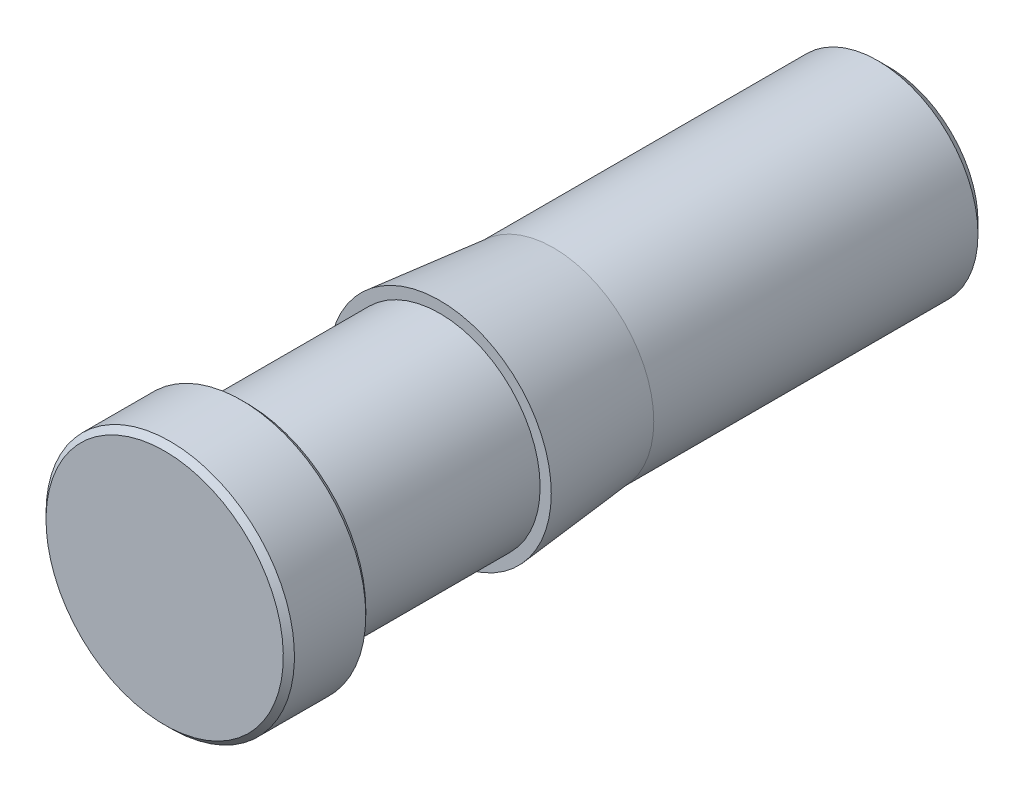
ISO-10303-21;
HEADER;
FILE_DESCRIPTION(('STEP AP214'),'2;1');
FILE_NAME('part.step','',(''),(''),'','','');
FILE_SCHEMA(('AUTOMOTIVE_DESIGN { 1 0 10303 214 1 1 1 1 }'));
ENDSEC;
DATA;
#1=APPLICATION_CONTEXT('core data for automotive mechanical design processes');
#2=APPLICATION_PROTOCOL_DEFINITION('international standard','automotive_design',2000,#1);
#3=PRODUCT_CONTEXT('',#1,'mechanical');
#4=PRODUCT('Part','Part','',(#3));
#5=PRODUCT_RELATED_PRODUCT_CATEGORY('part','',(#4));
#6=PRODUCT_DEFINITION_FORMATION('','',#4);
#7=PRODUCT_DEFINITION_CONTEXT('part definition',#1,'design');
#8=PRODUCT_DEFINITION('design','',#6,#7);
#9=PRODUCT_DEFINITION_SHAPE('','',#8);
#10=(LENGTH_UNIT() NAMED_UNIT(*) SI_UNIT(.MILLI.,.METRE.));
#11=(NAMED_UNIT(*) PLANE_ANGLE_UNIT() SI_UNIT($,.RADIAN.));
#12=(NAMED_UNIT(*) SI_UNIT($,.STERADIAN.) SOLID_ANGLE_UNIT());
#13=UNCERTAINTY_MEASURE_WITH_UNIT(LENGTH_MEASURE(1.E-05),#10,'distance_accuracy_value','');
#14=(GEOMETRIC_REPRESENTATION_CONTEXT(3) GLOBAL_UNCERTAINTY_ASSIGNED_CONTEXT((#13)) GLOBAL_UNIT_ASSIGNED_CONTEXT((#10,
#11,#12)) REPRESENTATION_CONTEXT('',''));
#15=CARTESIAN_POINT('',(0.,0.,0.));
#16=DIRECTION('',(0.,0.,1.));
#17=DIRECTION('',(1.,0.,0.));
#18=AXIS2_PLACEMENT_3D('',#15,#16,#17);
#19=CARTESIAN_POINT('',(0.,0.,0.));
#20=DIRECTION('',(0.,0.,1.));
#21=DIRECTION('',(1.,0.,0.));
#22=AXIS2_PLACEMENT_3D('',#19,#20,#21);
#23=PLANE('',#22);
#24=CARTESIAN_POINT('',(0.,0.,0.));
#25=DIRECTION('',(0.,0.,-1.));
#26=DIRECTION('',(0.,1.,0.));
#27=AXIS2_PLACEMENT_3D('',#24,#25,#26);
#28=CIRCLE('',#27,1.06500000003962);
#29=CARTESIAN_POINT('',(0.,1.06500000003962,0.));
#30=VERTEX_POINT('',#29);
#31=EDGE_CURVE('E20',#30,#30,#28,.T.);
#32=ORIENTED_EDGE('',*,*,#31,.F.);
#33=EDGE_LOOP('',(#32));
#34=FACE_BOUND('',#33,.T.);
#35=ADVANCED_FACE('F17',(#34),#23,.T.);
#36=CARTESIAN_POINT('',(0.,0.,-0.049999999987449));
#37=DIRECTION('',(0.,0.,-1.));
#38=DIRECTION('',(0.,1.,0.));
#39=AXIS2_PLACEMENT_3D('',#36,#37,#38);
#40=CONICAL_SURFACE('',#39,1.11500000002707,0.785398163397448);
#41=CARTESIAN_POINT('',(0.,0.,-0.0500000000000006));
#42=DIRECTION('',(0.,0.,-1.));
#43=DIRECTION('',(-1.,0.,0.));
#44=AXIS2_PLACEMENT_3D('',#41,#42,#43);
#45=CIRCLE('',#44,1.115);
#46=CARTESIAN_POINT('',(-1.115,0.,-0.0500000000000006));
#47=VERTEX_POINT('',#46);
#48=EDGE_CURVE('E49',#47,#47,#45,.T.);
#49=ORIENTED_EDGE('',*,*,#48,.F.);
#50=EDGE_LOOP('',(#49));
#51=FACE_BOUND('',#50,.T.);
#52=ORIENTED_EDGE('',*,*,#31,.T.);
#53=EDGE_LOOP('',(#52));
#54=FACE_BOUND('',#53,.T.);
#55=ADVANCED_FACE('F151',(#51,#54),#40,.T.);
#56=CARTESIAN_POINT('',(0.,0.,-6.50000000000001));
#57=DIRECTION('',(0.,0.,-1.));
#58=DIRECTION('',(-1.,0.,0.));
#59=AXIS2_PLACEMENT_3D('',#56,#57,#58);
#60=CYLINDRICAL_SURFACE('',#59,1.115);
#61=CARTESIAN_POINT('',(0.,0.,-0.68999999996322));
#62=DIRECTION('',(0.,0.,1.));
#63=DIRECTION('',(1.,0.,0.));
#64=AXIS2_PLACEMENT_3D('',#61,#62,#63);
#65=CIRCLE('',#64,1.11499999997022);
#66=CARTESIAN_POINT('',(1.11499999997022,0.,-0.68999999996322));
#67=VERTEX_POINT('',#66);
#68=EDGE_CURVE('E41',#67,#67,#65,.F.);
#69=ORIENTED_EDGE('',*,*,#68,.F.);
#70=EDGE_LOOP('',(#69));
#71=FACE_BOUND('',#70,.T.);
#72=ORIENTED_EDGE('',*,*,#48,.T.);
#73=EDGE_LOOP('',(#72));
#74=FACE_BOUND('',#73,.T.);
#75=ADVANCED_FACE('F33',(#71,#74),#60,.T.);
#76=CARTESIAN_POINT('',(0.,0.,-5.1699999999073));
#77=DIRECTION('',(0.,0.,-1.));
#78=DIRECTION('',(-1.,0.,0.));
#79=AXIS2_PLACEMENT_3D('',#76,#77,#78);
#80=CONICAL_SURFACE('',#79,0.649999999836837,1.04719755065528);
#81=CARTESIAN_POINT('',(2.27373675443232E-10,0.,-4.79472232490252));
#82=VERTEX_POINT('',#81);
#83=VERTEX_LOOP('',#82);
#84=FACE_BOUND('',#83,.T.);
#85=CARTESIAN_POINT('',(0.,0.,-5.17));
#86=DIRECTION('',(0.,0.,-1.));
#87=DIRECTION('',(-1.,0.,0.));
#88=AXIS2_PLACEMENT_3D('',#85,#86,#87);
#89=CIRCLE('',#88,0.65);
#90=CARTESIAN_POINT('',(-0.65,0.,-5.17));
#91=VERTEX_POINT('',#90);
#92=EDGE_CURVE('E37',#91,#91,#89,.T.);
#93=ORIENTED_EDGE('',*,*,#92,.T.);
#94=EDGE_LOOP('',(#93));
#95=FACE_BOUND('',#94,.T.);
#96=ADVANCED_FACE('F29',(#84,#95),#80,.F.);
#97=CARTESIAN_POINT('',(0.,0.,-0.68999999996322));
#98=DIRECTION('',(0.,0.,1.));
#99=DIRECTION('',(1.,0.,0.));
#100=AXIS2_PLACEMENT_3D('',#97,#98,#99);
#101=CONICAL_SURFACE('',#100,1.11499999997022,0.785398163397448);
#102=CARTESIAN_POINT('',(0.,0.,-0.739999999950669));
#103=DIRECTION('',(0.,0.,1.));
#104=DIRECTION('',(1.,0.,0.));
#105=AXIS2_PLACEMENT_3D('',#102,#103,#104);
#106=CIRCLE('',#105,1.06499999998277);
#107=CARTESIAN_POINT('',(1.06499999998277,0.,-0.739999999950669));
#108=VERTEX_POINT('',#107);
#109=EDGE_CURVE('E40',#108,#108,#106,.F.);
#110=ORIENTED_EDGE('',*,*,#109,.F.);
#111=EDGE_LOOP('',(#110));
#112=FACE_BOUND('',#111,.T.);
#113=ORIENTED_EDGE('',*,*,#68,.T.);
#114=EDGE_LOOP('',(#113));
#115=FACE_BOUND('',#114,.T.);
#116=ADVANCED_FACE('F32',(#112,#115),#101,.T.);
#117=CARTESIAN_POINT('',(0.,0.,-6.5));
#118=DIRECTION('',(0.,0.,-1.));
#119=DIRECTION('',(-1.,0.,0.));
#120=AXIS2_PLACEMENT_3D('',#117,#118,#119);
#121=CYLINDRICAL_SURFACE('',#120,0.65);
#122=ORIENTED_EDGE('',*,*,#92,.F.);
#123=EDGE_LOOP('',(#122));
#124=FACE_BOUND('',#123,.T.);
#125=CARTESIAN_POINT('',(0.,0.,-6.45000000002938));
#126=DIRECTION('',(0.,0.,-1.));
#127=DIRECTION('',(-1.,0.,0.));
#128=AXIS2_PLACEMENT_3D('',#125,#126,#127);
#129=CIRCLE('',#128,0.65000000006421);
#130=CARTESIAN_POINT('',(-0.65000000006421,0.,-6.45000000002938));
#131=VERTEX_POINT('',#130);
#132=EDGE_CURVE('E47',#131,#131,#129,.T.);
#133=ORIENTED_EDGE('',*,*,#132,.T.);
#134=EDGE_LOOP('',(#133));
#135=FACE_BOUND('',#134,.T.);
#136=ADVANCED_FACE('F143',(#124,#135),#121,.F.);
#137=CARTESIAN_POINT('',(0.,1.115,-0.74));
#138=DIRECTION('',(0.,0.,-1.));
#139=DIRECTION('',(-1.,0.,0.));
#140=AXIS2_PLACEMENT_3D('',#137,#138,#139);
#141=PLANE('',#140);
#142=CARTESIAN_POINT('',(0.,0.,-0.74));
#143=DIRECTION('',(0.,0.,-1.));
#144=DIRECTION('',(-1.,0.,0.));
#145=AXIS2_PLACEMENT_3D('',#142,#143,#144);
#146=CIRCLE('',#145,0.899999999999999);
#147=CARTESIAN_POINT('',(-0.899999999999999,0.,-0.74));
#148=VERTEX_POINT('',#147);
#149=EDGE_CURVE('E80',#148,#148,#146,.T.);
#150=ORIENTED_EDGE('',*,*,#149,.F.);
#151=EDGE_LOOP('',(#150));
#152=FACE_BOUND('',#151,.T.);
#153=ORIENTED_EDGE('',*,*,#109,.T.);
#154=EDGE_LOOP('',(#153));
#155=FACE_BOUND('',#154,.T.);
#156=ADVANCED_FACE('F137',(#152,#155),#141,.T.);
#157=CARTESIAN_POINT('',(0.,0.,-6.49999999990314));
#158=DIRECTION('',(0.,0.,-1.));
#159=DIRECTION('',(-1.,0.,0.));
#160=AXIS2_PLACEMENT_3D('',#157,#158,#159);
#161=CONICAL_SURFACE('',#160,0.699999999937972,0.785398163397448);
#162=ORIENTED_EDGE('',*,*,#132,.F.);
#163=EDGE_LOOP('',(#162));
#164=FACE_BOUND('',#163,.T.);
#165=CARTESIAN_POINT('',(0.,0.,-6.50000000001683));
#166=DIRECTION('',(0.,0.,-1.));
#167=DIRECTION('',(-1.,0.,0.));
#168=AXIS2_PLACEMENT_3D('',#165,#166,#167);
#169=CIRCLE('',#168,0.700000000051659);
#170=CARTESIAN_POINT('',(-0.700000000051659,0.,-6.50000000001683));
#171=VERTEX_POINT('',#170);
#172=EDGE_CURVE('E76',#171,#171,#169,.F.);
#173=ORIENTED_EDGE('',*,*,#172,.F.);
#174=EDGE_LOOP('',(#173));
#175=FACE_BOUND('',#174,.T.);
#176=ADVANCED_FACE('F129',(#164,#175),#161,.F.);
#177=CARTESIAN_POINT('',(0.,0.,-6.50000000000001));
#178=DIRECTION('',(0.,0.,-1.));
#179=DIRECTION('',(-1.,0.,0.));
#180=AXIS2_PLACEMENT_3D('',#177,#178,#179);
#181=CYLINDRICAL_SURFACE('',#180,0.899999999999999);
#182=CARTESIAN_POINT('',(0.,0.,-2.47));
#183=DIRECTION('',(0.,0.,-1.));
#184=DIRECTION('',(-1.,0.,0.));
#185=AXIS2_PLACEMENT_3D('',#182,#183,#184);
#186=CIRCLE('',#185,0.899999999999999);
#187=CARTESIAN_POINT('',(-0.899999999999999,0.,-2.47));
#188=VERTEX_POINT('',#187);
#189=EDGE_CURVE('E72',#188,#188,#186,.T.);
#190=ORIENTED_EDGE('',*,*,#189,.F.);
#191=EDGE_LOOP('',(#190));
#192=FACE_BOUND('',#191,.T.);
#193=ORIENTED_EDGE('',*,*,#149,.T.);
#194=EDGE_LOOP('',(#193));
#195=FACE_BOUND('',#194,.T.);
#196=ADVANCED_FACE('F127',(#192,#195),#181,.T.);
#197=CARTESIAN_POINT('',(0.,0.899999999999999,-6.5));
#198=DIRECTION('',(0.,0.,-1.));
#199=DIRECTION('',(-1.,0.,0.));
#200=AXIS2_PLACEMENT_3D('',#197,#198,#199);
#201=PLANE('',#200);
#202=ORIENTED_EDGE('',*,*,#172,.T.);
#203=EDGE_LOOP('',(#202));
#204=FACE_BOUND('',#203,.T.);
#205=CARTESIAN_POINT('',(0.,0.,-6.50000000007367));
#206=DIRECTION('',(0.,0.,1.));
#207=DIRECTION('',(0.,-1.,0.));
#208=AXIS2_PLACEMENT_3D('',#205,#206,#207);
#209=CIRCLE('',#208,0.799999999969714);
#210=CARTESIAN_POINT('',(0.,-0.799999999969714,-6.50000000007367));
#211=VERTEX_POINT('',#210);
#212=EDGE_CURVE('E68',#211,#211,#209,.T.);
#213=ORIENTED_EDGE('',*,*,#212,.F.);
#214=EDGE_LOOP('',(#213));
#215=FACE_BOUND('',#214,.T.);
#216=ADVANCED_FACE('F113',(#204,#215),#201,.T.);
#217=CARTESIAN_POINT('',(0.,0.899999999999999,-2.47));
#218=DIRECTION('',(0.,0.,1.));
#219=DIRECTION('',(1.,0.,0.));
#220=AXIS2_PLACEMENT_3D('',#217,#218,#219);
#221=PLANE('',#220);
#222=CARTESIAN_POINT('',(0.,0.,-2.47000000001663));
#223=DIRECTION('',(0.,0.,1.));
#224=DIRECTION('',(1.,0.,0.));
#225=AXIS2_PLACEMENT_3D('',#222,#223,#224);
#226=CIRCLE('',#225,0.999999999985966);
#227=CARTESIAN_POINT('',(0.999999999985966,0.,-2.47000000001663));
#228=VERTEX_POINT('',#227);
#229=EDGE_CURVE('E64',#228,#228,#226,.F.);
#230=ORIENTED_EDGE('',*,*,#229,.F.);
#231=EDGE_LOOP('',(#230));
#232=FACE_BOUND('',#231,.T.);
#233=ORIENTED_EDGE('',*,*,#189,.T.);
#234=EDGE_LOOP('',(#233));
#235=FACE_BOUND('',#234,.T.);
#236=ADVANCED_FACE('F103',(#232,#235),#221,.T.);
#237=CARTESIAN_POINT('',(0.,0.,-6.40000000009877));
#238=DIRECTION('',(0.,0.,1.));
#239=DIRECTION('',(0.,-1.,0.));
#240=AXIS2_PLACEMENT_3D('',#237,#238,#239);
#241=CONICAL_SURFACE('',#240,0.899999999944612,0.785398163397448);
#242=ORIENTED_EDGE('',*,*,#212,.T.);
#243=EDGE_LOOP('',(#242));
#244=FACE_BOUND('',#243,.T.);
#245=CARTESIAN_POINT('',(0.,0.,-6.4));
#246=DIRECTION('',(0.,0.,-1.));
#247=DIRECTION('',(-1.,0.,0.));
#248=AXIS2_PLACEMENT_3D('',#245,#246,#247);
#249=CIRCLE('',#248,0.899999999999999);
#250=CARTESIAN_POINT('',(-0.899999999999999,0.,-6.4));
#251=VERTEX_POINT('',#250);
#252=EDGE_CURVE('E25',#251,#251,#249,.F.);
#253=ORIENTED_EDGE('',*,*,#252,.F.);
#254=EDGE_LOOP('',(#253));
#255=FACE_BOUND('',#254,.T.);
#256=ADVANCED_FACE('F100',(#244,#255),#241,.T.);
#257=CARTESIAN_POINT('',(0.,0.,-2.47000000018716));
#258=DIRECTION('',(0.,0.,1.));
#259=DIRECTION('',(1.,0.,0.));
#260=AXIS2_PLACEMENT_3D('',#257,#258,#259);
#261=CONICAL_SURFACE('',#260,0.999999999969248,0.0977269073566894);
#262=CARTESIAN_POINT('',(0.,0.,-3.49));
#263=DIRECTION('',(0.,0.,-1.));
#264=DIRECTION('',(-1.,0.,0.));
#265=AXIS2_PLACEMENT_3D('',#262,#263,#264);
#266=CIRCLE('',#265,0.899999999999999);
#267=CARTESIAN_POINT('',(-0.899999999999999,0.,-3.49));
#268=VERTEX_POINT('',#267);
#269=EDGE_CURVE('E11',#268,#268,#266,.T.);
#270=ORIENTED_EDGE('',*,*,#269,.F.);
#271=EDGE_LOOP('',(#270));
#272=FACE_BOUND('',#271,.T.);
#273=ORIENTED_EDGE('',*,*,#229,.T.);
#274=EDGE_LOOP('',(#273));
#275=FACE_BOUND('',#274,.T.);
#276=ADVANCED_FACE('F102',(#272,#275),#261,.T.);
#277=CARTESIAN_POINT('',(0.,0.,-6.50000000000001));
#278=DIRECTION('',(0.,0.,-1.));
#279=DIRECTION('',(-1.,0.,0.));
#280=AXIS2_PLACEMENT_3D('',#277,#278,#279);
#281=CYLINDRICAL_SURFACE('',#280,0.899999999999999);
#282=ORIENTED_EDGE('',*,*,#269,.T.);
#283=EDGE_LOOP('',(#282));
#284=FACE_BOUND('',#283,.T.);
#285=ORIENTED_EDGE('',*,*,#252,.T.);
#286=EDGE_LOOP('',(#285));
#287=FACE_BOUND('',#286,.T.);
#288=ADVANCED_FACE('F98',(#284,#287),#281,.T.);
#289=CLOSED_SHELL('',(#35,#55,#75,#96,#116,#136,#156,#176,#196,#216,#236,#256,#276,#288));
#290=MANIFOLD_SOLID_BREP('B1',#289);
#291=ADVANCED_BREP_SHAPE_REPRESENTATION('',(#18,#290),#14);
#292=SHAPE_DEFINITION_REPRESENTATION(#9,#291);
ENDSEC;
END-ISO-10303-21;
